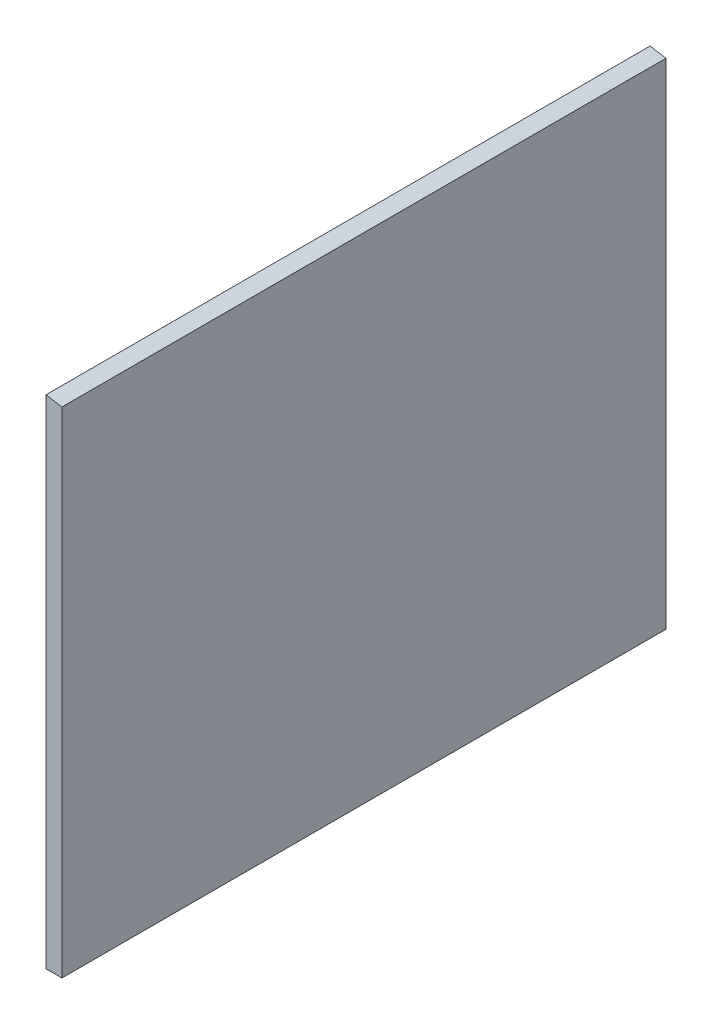
ISO-10303-21;
HEADER;
FILE_DESCRIPTION(('STEP AP214'),'2;1');
FILE_NAME('part.step','',(''),(''),'','','');
FILE_SCHEMA(('AUTOMOTIVE_DESIGN { 1 0 10303 214 1 1 1 1 }'));
ENDSEC;
DATA;
#1=APPLICATION_CONTEXT('core data for automotive mechanical design processes');
#2=APPLICATION_PROTOCOL_DEFINITION('international standard','automotive_design',2000,#1);
#3=PRODUCT_CONTEXT('',#1,'mechanical');
#4=PRODUCT('Part','Part','',(#3));
#5=PRODUCT_RELATED_PRODUCT_CATEGORY('part','',(#4));
#6=PRODUCT_DEFINITION_FORMATION('','',#4);
#7=PRODUCT_DEFINITION_CONTEXT('part definition',#1,'design');
#8=PRODUCT_DEFINITION('design','',#6,#7);
#9=PRODUCT_DEFINITION_SHAPE('','',#8);
#10=(LENGTH_UNIT() NAMED_UNIT(*) SI_UNIT(.MILLI.,.METRE.));
#11=(NAMED_UNIT(*) PLANE_ANGLE_UNIT() SI_UNIT($,.RADIAN.));
#12=(NAMED_UNIT(*) SI_UNIT($,.STERADIAN.) SOLID_ANGLE_UNIT());
#13=UNCERTAINTY_MEASURE_WITH_UNIT(LENGTH_MEASURE(1.E-05),#10,'distance_accuracy_value','');
#14=(GEOMETRIC_REPRESENTATION_CONTEXT(3) GLOBAL_UNCERTAINTY_ASSIGNED_CONTEXT((#13)) GLOBAL_UNIT_ASSIGNED_CONTEXT((#10,
#11,#12)) REPRESENTATION_CONTEXT('',''));
#15=CARTESIAN_POINT('',(0.,0.,0.));
#16=DIRECTION('',(0.,0.,1.));
#17=DIRECTION('',(1.,0.,0.));
#18=AXIS2_PLACEMENT_3D('',#15,#16,#17);
#19=CARTESIAN_POINT('',(3.,0.,57.094));
#20=DIRECTION('',(0.,1.,0.));
#21=DIRECTION('',(-1.,0.,0.));
#22=AXIS2_PLACEMENT_3D('',#19,#20,#21);
#23=PLANE('',#22);
#24=DIRECTION('',(1.,0.,0.));
#25=VECTOR('',#24,1.);
#26=CARTESIAN_POINT('',(3.,0.,-57.094));
#27=LINE('',#26,#25);
#28=CARTESIAN_POINT('',(0.,0.,-57.094));
#29=VERTEX_POINT('',#28);
#30=CARTESIAN_POINT('',(3.,0.,-57.094));
#31=VERTEX_POINT('',#30);
#32=EDGE_CURVE('E95',#29,#31,#27,.T.);
#33=ORIENTED_EDGE('',*,*,#32,.T.);
#34=DIRECTION('',(0.,0.,-1.));
#35=VECTOR('',#34,1.);
#36=CARTESIAN_POINT('',(3.,0.,57.094));
#37=LINE('',#36,#35);
#38=CARTESIAN_POINT('',(3.,0.,57.094));
#39=VERTEX_POINT('',#38);
#40=EDGE_CURVE('E11',#39,#31,#37,.T.);
#41=ORIENTED_EDGE('',*,*,#40,.F.);
#42=DIRECTION('',(1.,0.,0.));
#43=VECTOR('',#42,1.);
#44=CARTESIAN_POINT('',(3.,0.,57.094));
#45=LINE('',#44,#43);
#46=CARTESIAN_POINT('',(0.,0.,57.094));
#47=VERTEX_POINT('',#46);
#48=EDGE_CURVE('E83',#47,#39,#45,.T.);
#49=ORIENTED_EDGE('',*,*,#48,.F.);
#50=DIRECTION('',(0.,0.,-1.));
#51=VECTOR('',#50,1.);
#52=CARTESIAN_POINT('',(0.,0.,57.094));
#53=LINE('',#52,#51);
#54=EDGE_CURVE('E91',#47,#29,#53,.T.);
#55=ORIENTED_EDGE('',*,*,#54,.T.);
#56=EDGE_LOOP('',(#33,#41,#49,#55));
#57=FACE_BOUND('',#56,.T.);
#58=ADVANCED_FACE('F32',(#57),#23,.F.);
#59=CARTESIAN_POINT('',(2.99999999999999,93.4704334155987,57.094));
#60=DIRECTION('',(-1.,0.,0.));
#61=DIRECTION('',(0.,-1.,0.));
#62=AXIS2_PLACEMENT_3D('',#59,#60,#61);
#63=PLANE('',#62);
#64=DIRECTION('',(0.,1.,0.));
#65=VECTOR('',#64,1.);
#66=CARTESIAN_POINT('',(2.99999999999999,93.4704334155987,-57.094));
#67=LINE('',#66,#65);
#68=CARTESIAN_POINT('',(2.99999999999999,93.4704334155987,-57.094));
#69=VERTEX_POINT('',#68);
#70=EDGE_CURVE('E87',#31,#69,#67,.T.);
#71=ORIENTED_EDGE('',*,*,#70,.T.);
#72=DIRECTION('',(0.,0.,-1.));
#73=VECTOR('',#72,1.);
#74=CARTESIAN_POINT('',(2.99999999999999,93.4704334155987,57.094));
#75=LINE('',#74,#73);
#76=CARTESIAN_POINT('',(2.99999999999999,93.4704334155987,57.094));
#77=VERTEX_POINT('',#76);
#78=EDGE_CURVE('E40',#77,#69,#75,.T.);
#79=ORIENTED_EDGE('',*,*,#78,.F.);
#80=DIRECTION('',(0.,1.,0.));
#81=VECTOR('',#80,1.);
#82=CARTESIAN_POINT('',(2.99999999999999,93.4704334155987,57.094));
#83=LINE('',#82,#81);
#84=EDGE_CURVE('E78',#39,#77,#83,.T.);
#85=ORIENTED_EDGE('',*,*,#84,.F.);
#86=ORIENTED_EDGE('',*,*,#40,.T.);
#87=EDGE_LOOP('',(#71,#79,#85,#86));
#88=FACE_BOUND('',#87,.T.);
#89=ADVANCED_FACE('F86',(#88),#63,.F.);
#90=CARTESIAN_POINT('',(0.,93.98,57.094));
#91=DIRECTION('',(-0.16745706111,-0.985879370249932,0.));
#92=DIRECTION('',(0.985879370249932,-0.16745706111,0.));
#93=AXIS2_PLACEMENT_3D('',#90,#91,#92);
#94=PLANE('',#93);
#95=DIRECTION('',(-0.985879370249932,0.16745706111,0.));
#96=VECTOR('',#95,1.);
#97=CARTESIAN_POINT('',(0.,93.98,-57.094));
#98=LINE('',#97,#96);
#99=CARTESIAN_POINT('',(0.,93.98,-57.094));
#100=VERTEX_POINT('',#99);
#101=EDGE_CURVE('E65',#69,#100,#98,.T.);
#102=ORIENTED_EDGE('',*,*,#101,.T.);
#103=DIRECTION('',(0.,0.,-1.));
#104=VECTOR('',#103,1.);
#105=CARTESIAN_POINT('',(0.,93.98,57.094));
#106=LINE('',#105,#104);
#107=CARTESIAN_POINT('',(0.,93.98,57.094));
#108=VERTEX_POINT('',#107);
#109=EDGE_CURVE('E88',#108,#100,#106,.T.);
#110=ORIENTED_EDGE('',*,*,#109,.F.);
#111=DIRECTION('',(-0.985879370249932,0.16745706111,0.));
#112=VECTOR('',#111,1.);
#113=CARTESIAN_POINT('',(0.,93.98,57.094));
#114=LINE('',#113,#112);
#115=EDGE_CURVE('E81',#77,#108,#114,.T.);
#116=ORIENTED_EDGE('',*,*,#115,.F.);
#117=ORIENTED_EDGE('',*,*,#78,.T.);
#118=EDGE_LOOP('',(#102,#110,#116,#117));
#119=FACE_BOUND('',#118,.T.);
#120=ADVANCED_FACE('F89',(#119),#94,.F.);
#121=CARTESIAN_POINT('',(0.,0.,57.094));
#122=DIRECTION('',(1.,0.,0.));
#123=DIRECTION('',(0.,0.,-1.));
#124=AXIS2_PLACEMENT_3D('',#121,#122,#123);
#125=PLANE('',#124);
#126=DIRECTION('',(0.,-1.,0.));
#127=VECTOR('',#126,1.);
#128=CARTESIAN_POINT('',(0.,0.,-57.094));
#129=LINE('',#128,#127);
#130=EDGE_CURVE('E71',#100,#29,#129,.T.);
#131=ORIENTED_EDGE('',*,*,#130,.T.);
#132=ORIENTED_EDGE('',*,*,#54,.F.);
#133=DIRECTION('',(0.,-1.,0.));
#134=VECTOR('',#133,1.);
#135=CARTESIAN_POINT('',(0.,0.,57.094));
#136=LINE('',#135,#134);
#137=EDGE_CURVE('E48',#108,#47,#136,.T.);
#138=ORIENTED_EDGE('',*,*,#137,.F.);
#139=ORIENTED_EDGE('',*,*,#109,.T.);
#140=EDGE_LOOP('',(#131,#132,#138,#139));
#141=FACE_BOUND('',#140,.T.);
#142=ADVANCED_FACE('F102',(#141),#125,.F.);
#143=CARTESIAN_POINT('',(0.,0.,57.094));
#144=DIRECTION('',(0.,0.,-1.));
#145=DIRECTION('',(-1.,0.,0.));
#146=AXIS2_PLACEMENT_3D('',#143,#144,#145);
#147=PLANE('',#146);
#148=ORIENTED_EDGE('',*,*,#48,.T.);
#149=ORIENTED_EDGE('',*,*,#84,.T.);
#150=ORIENTED_EDGE('',*,*,#115,.T.);
#151=ORIENTED_EDGE('',*,*,#137,.T.);
#152=EDGE_LOOP('',(#148,#149,#150,#151));
#153=FACE_BOUND('',#152,.T.);
#154=ADVANCED_FACE('F79',(#153),#147,.F.);
#155=CARTESIAN_POINT('',(0.,0.,-57.094));
#156=DIRECTION('',(0.,0.,-1.));
#157=DIRECTION('',(-1.,0.,0.));
#158=AXIS2_PLACEMENT_3D('',#155,#156,#157);
#159=PLANE('',#158);
#160=ORIENTED_EDGE('',*,*,#32,.F.);
#161=ORIENTED_EDGE('',*,*,#130,.F.);
#162=ORIENTED_EDGE('',*,*,#101,.F.);
#163=ORIENTED_EDGE('',*,*,#70,.F.);
#164=EDGE_LOOP('',(#160,#161,#162,#163));
#165=FACE_BOUND('',#164,.T.);
#166=ADVANCED_FACE('F105',(#165),#159,.T.);
#167=CLOSED_SHELL('',(#58,#89,#120,#142,#154,#166));
#168=MANIFOLD_SOLID_BREP('B2',#167);
#169=ADVANCED_BREP_SHAPE_REPRESENTATION('',(#18,#168),#14);
#170=SHAPE_DEFINITION_REPRESENTATION(#9,#169);
ENDSEC;
END-ISO-10303-21;
